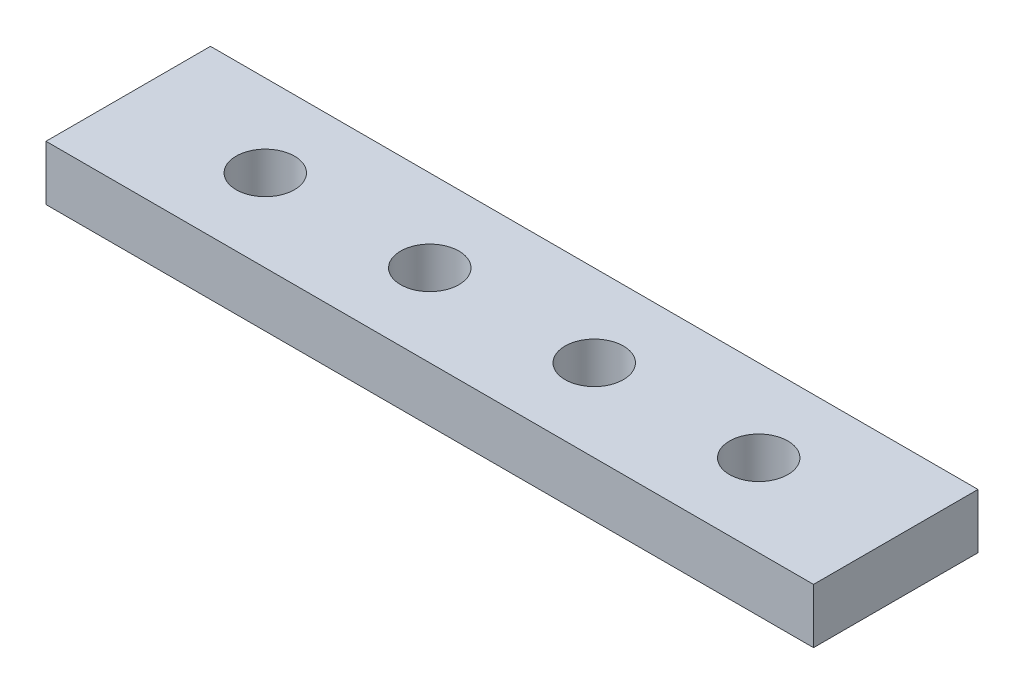
ISO-10303-21;
HEADER;
FILE_DESCRIPTION(('STEP AP214'),'2;1');
FILE_NAME('part.step','',(''),(''),'','','');
FILE_SCHEMA(('AUTOMOTIVE_DESIGN { 1 0 10303 214 1 1 1 1 }'));
ENDSEC;
DATA;
#1=APPLICATION_CONTEXT('core data for automotive mechanical design processes');
#2=APPLICATION_PROTOCOL_DEFINITION('international standard','automotive_design',2000,#1);
#3=PRODUCT_CONTEXT('',#1,'mechanical');
#4=PRODUCT('Part','Part','',(#3));
#5=PRODUCT_RELATED_PRODUCT_CATEGORY('part','',(#4));
#6=PRODUCT_DEFINITION_FORMATION('','',#4);
#7=PRODUCT_DEFINITION_CONTEXT('part definition',#1,'design');
#8=PRODUCT_DEFINITION('design','',#6,#7);
#9=PRODUCT_DEFINITION_SHAPE('','',#8);
#10=(LENGTH_UNIT() NAMED_UNIT(*) SI_UNIT(.MILLI.,.METRE.));
#11=(NAMED_UNIT(*) PLANE_ANGLE_UNIT() SI_UNIT($,.RADIAN.));
#12=(NAMED_UNIT(*) SI_UNIT($,.STERADIAN.) SOLID_ANGLE_UNIT());
#13=UNCERTAINTY_MEASURE_WITH_UNIT(LENGTH_MEASURE(1.E-05),#10,'distance_accuracy_value','');
#14=(GEOMETRIC_REPRESENTATION_CONTEXT(3) GLOBAL_UNCERTAINTY_ASSIGNED_CONTEXT((#13)) GLOBAL_UNIT_ASSIGNED_CONTEXT((#10,
#11,#12)) REPRESENTATION_CONTEXT('',''));
#15=CARTESIAN_POINT('',(0.,0.,0.));
#16=DIRECTION('',(0.,0.,1.));
#17=DIRECTION('',(1.,0.,0.));
#18=AXIS2_PLACEMENT_3D('',#15,#16,#17);
#19=CARTESIAN_POINT('',(44.45,6.35,9.525));
#20=DIRECTION('',(-1.,0.,0.));
#21=DIRECTION('',(0.,0.,1.));
#22=AXIS2_PLACEMENT_3D('',#19,#20,#21);
#23=PLANE('',#22);
#24=DIRECTION('',(0.,0.,-1.));
#25=VECTOR('',#24,1.);
#26=CARTESIAN_POINT('',(44.45,0.,9.525));
#27=LINE('',#26,#25);
#28=CARTESIAN_POINT('',(44.45,0.,9.525));
#29=VERTEX_POINT('',#28);
#30=CARTESIAN_POINT('',(44.45,0.,-9.525));
#31=VERTEX_POINT('',#30);
#32=EDGE_CURVE('E96',#29,#31,#27,.T.);
#33=ORIENTED_EDGE('',*,*,#32,.T.);
#34=DIRECTION('',(0.,-1.,0.));
#35=VECTOR('',#34,1.);
#36=CARTESIAN_POINT('',(44.45,6.35,-9.525));
#37=LINE('',#36,#35);
#38=CARTESIAN_POINT('',(44.45,6.35,-9.525));
#39=VERTEX_POINT('',#38);
#40=EDGE_CURVE('E11',#39,#31,#37,.T.);
#41=ORIENTED_EDGE('',*,*,#40,.F.);
#42=DIRECTION('',(0.,0.,-1.));
#43=VECTOR('',#42,1.);
#44=CARTESIAN_POINT('',(44.45,6.35,9.525));
#45=LINE('',#44,#43);
#46=CARTESIAN_POINT('',(44.45,6.35,9.525));
#47=VERTEX_POINT('',#46);
#48=EDGE_CURVE('E84',#47,#39,#45,.T.);
#49=ORIENTED_EDGE('',*,*,#48,.F.);
#50=DIRECTION('',(0.,-1.,0.));
#51=VECTOR('',#50,1.);
#52=CARTESIAN_POINT('',(44.45,6.35,9.525));
#53=LINE('',#52,#51);
#54=EDGE_CURVE('E92',#47,#29,#53,.T.);
#55=ORIENTED_EDGE('',*,*,#54,.T.);
#56=EDGE_LOOP('',(#33,#41,#49,#55));
#57=FACE_BOUND('',#56,.T.);
#58=ADVANCED_FACE('F33',(#57),#23,.F.);
#59=CARTESIAN_POINT('',(-44.45,6.35,-9.525));
#60=DIRECTION('',(0.,0.,1.));
#61=DIRECTION('',(1.,0.,0.));
#62=AXIS2_PLACEMENT_3D('',#59,#60,#61);
#63=PLANE('',#62);
#64=DIRECTION('',(-1.,0.,0.));
#65=VECTOR('',#64,1.);
#66=CARTESIAN_POINT('',(-44.45,0.,-9.525));
#67=LINE('',#66,#65);
#68=CARTESIAN_POINT('',(-44.45,0.,-9.525));
#69=VERTEX_POINT('',#68);
#70=EDGE_CURVE('E88',#31,#69,#67,.T.);
#71=ORIENTED_EDGE('',*,*,#70,.T.);
#72=DIRECTION('',(0.,-1.,0.));
#73=VECTOR('',#72,1.);
#74=CARTESIAN_POINT('',(-44.45,6.35,-9.525));
#75=LINE('',#74,#73);
#76=CARTESIAN_POINT('',(-44.45,6.35,-9.525));
#77=VERTEX_POINT('',#76);
#78=EDGE_CURVE('E41',#77,#69,#75,.T.);
#79=ORIENTED_EDGE('',*,*,#78,.F.);
#80=DIRECTION('',(-1.,0.,0.));
#81=VECTOR('',#80,1.);
#82=CARTESIAN_POINT('',(-44.45,6.35,-9.525));
#83=LINE('',#82,#81);
#84=EDGE_CURVE('E79',#39,#77,#83,.T.);
#85=ORIENTED_EDGE('',*,*,#84,.F.);
#86=ORIENTED_EDGE('',*,*,#40,.T.);
#87=EDGE_LOOP('',(#71,#79,#85,#86));
#88=FACE_BOUND('',#87,.T.);
#89=ADVANCED_FACE('F87',(#88),#63,.F.);
#90=CARTESIAN_POINT('',(-44.45,6.35,9.525));
#91=DIRECTION('',(1.,0.,0.));
#92=DIRECTION('',(0.,0.,-1.));
#93=AXIS2_PLACEMENT_3D('',#90,#91,#92);
#94=PLANE('',#93);
#95=DIRECTION('',(0.,0.,1.));
#96=VECTOR('',#95,1.);
#97=CARTESIAN_POINT('',(-44.45,0.,9.525));
#98=LINE('',#97,#96);
#99=CARTESIAN_POINT('',(-44.45,0.,9.525));
#100=VERTEX_POINT('',#99);
#101=EDGE_CURVE('E66',#69,#100,#98,.T.);
#102=ORIENTED_EDGE('',*,*,#101,.T.);
#103=DIRECTION('',(0.,-1.,0.));
#104=VECTOR('',#103,1.);
#105=CARTESIAN_POINT('',(-44.45,6.35,9.525));
#106=LINE('',#105,#104);
#107=CARTESIAN_POINT('',(-44.45,6.35,9.525));
#108=VERTEX_POINT('',#107);
#109=EDGE_CURVE('E89',#108,#100,#106,.T.);
#110=ORIENTED_EDGE('',*,*,#109,.F.);
#111=DIRECTION('',(0.,0.,1.));
#112=VECTOR('',#111,1.);
#113=CARTESIAN_POINT('',(-44.45,6.35,9.525));
#114=LINE('',#113,#112);
#115=EDGE_CURVE('E82',#77,#108,#114,.T.);
#116=ORIENTED_EDGE('',*,*,#115,.F.);
#117=ORIENTED_EDGE('',*,*,#78,.T.);
#118=EDGE_LOOP('',(#102,#110,#116,#117));
#119=FACE_BOUND('',#118,.T.);
#120=ADVANCED_FACE('F90',(#119),#94,.F.);
#121=CARTESIAN_POINT('',(-44.45,6.35,9.525));
#122=DIRECTION('',(0.,0.,-1.));
#123=DIRECTION('',(-1.,0.,0.));
#124=AXIS2_PLACEMENT_3D('',#121,#122,#123);
#125=PLANE('',#124);
#126=DIRECTION('',(1.,0.,0.));
#127=VECTOR('',#126,1.);
#128=CARTESIAN_POINT('',(-44.45,0.,9.525));
#129=LINE('',#128,#127);
#130=EDGE_CURVE('E72',#100,#29,#129,.T.);
#131=ORIENTED_EDGE('',*,*,#130,.T.);
#132=ORIENTED_EDGE('',*,*,#54,.F.);
#133=DIRECTION('',(1.,0.,0.));
#134=VECTOR('',#133,1.);
#135=CARTESIAN_POINT('',(-44.45,6.35,9.525));
#136=LINE('',#135,#134);
#137=EDGE_CURVE('E49',#108,#47,#136,.T.);
#138=ORIENTED_EDGE('',*,*,#137,.F.);
#139=ORIENTED_EDGE('',*,*,#109,.T.);
#140=EDGE_LOOP('',(#131,#132,#138,#139));
#141=FACE_BOUND('',#140,.T.);
#142=ADVANCED_FACE('F104',(#141),#125,.F.);
#143=CARTESIAN_POINT('',(0.,6.35,0.));
#144=DIRECTION('',(0.,-1.,0.));
#145=DIRECTION('',(0.,0.,-1.));
#146=AXIS2_PLACEMENT_3D('',#143,#144,#145);
#147=PLANE('',#146);
#148=CARTESIAN_POINT('',(-28.575,6.35,0.));
#149=DIRECTION('',(0.,-1.,0.));
#150=DIRECTION('',(0.,0.,-1.));
#151=AXIS2_PLACEMENT_3D('',#148,#149,#150);
#152=CIRCLE('',#151,3.3782);
#153=CARTESIAN_POINT('',(-28.575,6.35,-3.3782));
#154=VERTEX_POINT('',#153);
#155=EDGE_CURVE('E127',#154,#154,#152,.T.);
#156=ORIENTED_EDGE('',*,*,#155,.T.);
#157=EDGE_LOOP('',(#156));
#158=FACE_BOUND('',#157,.T.);
#159=CARTESIAN_POINT('',(-9.525,6.35,0.));
#160=DIRECTION('',(0.,-1.,0.));
#161=DIRECTION('',(0.,0.,-1.));
#162=AXIS2_PLACEMENT_3D('',#159,#160,#161);
#163=CIRCLE('',#162,3.3782);
#164=CARTESIAN_POINT('',(-9.525,6.35,-3.3782));
#165=VERTEX_POINT('',#164);
#166=EDGE_CURVE('E121',#165,#165,#163,.T.);
#167=ORIENTED_EDGE('',*,*,#166,.T.);
#168=EDGE_LOOP('',(#167));
#169=FACE_BOUND('',#168,.T.);
#170=CARTESIAN_POINT('',(9.525,6.35,0.));
#171=DIRECTION('',(0.,-1.,0.));
#172=DIRECTION('',(0.,0.,-1.));
#173=AXIS2_PLACEMENT_3D('',#170,#171,#172);
#174=CIRCLE('',#173,3.3782);
#175=CARTESIAN_POINT('',(9.525,6.35,-3.3782));
#176=VERTEX_POINT('',#175);
#177=EDGE_CURVE('E115',#176,#176,#174,.T.);
#178=ORIENTED_EDGE('',*,*,#177,.T.);
#179=EDGE_LOOP('',(#178));
#180=FACE_BOUND('',#179,.T.);
#181=CARTESIAN_POINT('',(28.575,6.35,0.));
#182=DIRECTION('',(0.,-1.,0.));
#183=DIRECTION('',(0.,0.,-1.));
#184=AXIS2_PLACEMENT_3D('',#181,#182,#183);
#185=CIRCLE('',#184,3.3782);
#186=CARTESIAN_POINT('',(28.575,6.35,-3.3782));
#187=VERTEX_POINT('',#186);
#188=EDGE_CURVE('E99',#187,#187,#185,.T.);
#189=ORIENTED_EDGE('',*,*,#188,.T.);
#190=EDGE_LOOP('',(#189));
#191=FACE_BOUND('',#190,.T.);
#192=ORIENTED_EDGE('',*,*,#48,.T.);
#193=ORIENTED_EDGE('',*,*,#84,.T.);
#194=ORIENTED_EDGE('',*,*,#115,.T.);
#195=ORIENTED_EDGE('',*,*,#137,.T.);
#196=EDGE_LOOP('',(#192,#193,#194,#195));
#197=FACE_BOUND('',#196,.T.);
#198=ADVANCED_FACE('F80',(#158,#169,#180,#191,#197),#147,.F.);
#199=CARTESIAN_POINT('',(0.,0.,0.));
#200=DIRECTION('',(0.,-1.,0.));
#201=DIRECTION('',(0.,0.,-1.));
#202=AXIS2_PLACEMENT_3D('',#199,#200,#201);
#203=PLANE('',#202);
#204=CARTESIAN_POINT('',(-28.575,0.,0.));
#205=DIRECTION('',(0.,-1.,0.));
#206=DIRECTION('',(0.,0.,-1.));
#207=AXIS2_PLACEMENT_3D('',#204,#205,#206);
#208=CIRCLE('',#207,3.3782);
#209=CARTESIAN_POINT('',(-28.575,0.,-3.3782));
#210=VERTEX_POINT('',#209);
#211=EDGE_CURVE('E130',#210,#210,#208,.T.);
#212=ORIENTED_EDGE('',*,*,#211,.F.);
#213=EDGE_LOOP('',(#212));
#214=FACE_BOUND('',#213,.T.);
#215=CARTESIAN_POINT('',(-9.525,0.,0.));
#216=DIRECTION('',(0.,-1.,0.));
#217=DIRECTION('',(0.,0.,-1.));
#218=AXIS2_PLACEMENT_3D('',#215,#216,#217);
#219=CIRCLE('',#218,3.3782);
#220=CARTESIAN_POINT('',(-9.525,0.,-3.3782));
#221=VERTEX_POINT('',#220);
#222=EDGE_CURVE('E124',#221,#221,#219,.T.);
#223=ORIENTED_EDGE('',*,*,#222,.F.);
#224=EDGE_LOOP('',(#223));
#225=FACE_BOUND('',#224,.T.);
#226=CARTESIAN_POINT('',(9.525,0.,0.));
#227=DIRECTION('',(0.,-1.,0.));
#228=DIRECTION('',(0.,0.,-1.));
#229=AXIS2_PLACEMENT_3D('',#226,#227,#228);
#230=CIRCLE('',#229,3.3782);
#231=CARTESIAN_POINT('',(9.525,0.,-3.3782));
#232=VERTEX_POINT('',#231);
#233=EDGE_CURVE('E118',#232,#232,#230,.T.);
#234=ORIENTED_EDGE('',*,*,#233,.F.);
#235=EDGE_LOOP('',(#234));
#236=FACE_BOUND('',#235,.T.);
#237=CARTESIAN_POINT('',(28.575,0.,0.));
#238=DIRECTION('',(0.,-1.,0.));
#239=DIRECTION('',(0.,0.,-1.));
#240=AXIS2_PLACEMENT_3D('',#237,#238,#239);
#241=CIRCLE('',#240,3.3782);
#242=CARTESIAN_POINT('',(28.575,0.,-3.3782));
#243=VERTEX_POINT('',#242);
#244=EDGE_CURVE('E112',#243,#243,#241,.T.);
#245=ORIENTED_EDGE('',*,*,#244,.F.);
#246=EDGE_LOOP('',(#245));
#247=FACE_BOUND('',#246,.T.);
#248=ORIENTED_EDGE('',*,*,#32,.F.);
#249=ORIENTED_EDGE('',*,*,#130,.F.);
#250=ORIENTED_EDGE('',*,*,#101,.F.);
#251=ORIENTED_EDGE('',*,*,#70,.F.);
#252=EDGE_LOOP('',(#248,#249,#250,#251));
#253=FACE_BOUND('',#252,.T.);
#254=ADVANCED_FACE('F107',(#214,#225,#236,#247,#253),#203,.T.);
#255=CARTESIAN_POINT('',(28.575,0.,0.));
#256=DIRECTION('',(0.,-1.,0.));
#257=DIRECTION('',(0.,0.,-1.));
#258=AXIS2_PLACEMENT_3D('',#255,#256,#257);
#259=CYLINDRICAL_SURFACE('',#258,3.3782);
#260=ORIENTED_EDGE('',*,*,#188,.F.);
#261=EDGE_LOOP('',(#260));
#262=FACE_BOUND('',#261,.T.);
#263=ORIENTED_EDGE('',*,*,#244,.T.);
#264=EDGE_LOOP('',(#263));
#265=FACE_BOUND('',#264,.T.);
#266=ADVANCED_FACE('F138',(#262,#265),#259,.F.);
#267=CARTESIAN_POINT('',(9.525,0.,0.));
#268=DIRECTION('',(0.,-1.,0.));
#269=DIRECTION('',(0.,0.,-1.));
#270=AXIS2_PLACEMENT_3D('',#267,#268,#269);
#271=CYLINDRICAL_SURFACE('',#270,3.3782);
#272=ORIENTED_EDGE('',*,*,#177,.F.);
#273=EDGE_LOOP('',(#272));
#274=FACE_BOUND('',#273,.T.);
#275=ORIENTED_EDGE('',*,*,#233,.T.);
#276=EDGE_LOOP('',(#275));
#277=FACE_BOUND('',#276,.T.);
#278=ADVANCED_FACE('F147',(#274,#277),#271,.F.);
#279=CARTESIAN_POINT('',(-9.525,0.,0.));
#280=DIRECTION('',(0.,-1.,0.));
#281=DIRECTION('',(0.,0.,-1.));
#282=AXIS2_PLACEMENT_3D('',#279,#280,#281);
#283=CYLINDRICAL_SURFACE('',#282,3.3782);
#284=ORIENTED_EDGE('',*,*,#166,.F.);
#285=EDGE_LOOP('',(#284));
#286=FACE_BOUND('',#285,.T.);
#287=ORIENTED_EDGE('',*,*,#222,.T.);
#288=EDGE_LOOP('',(#287));
#289=FACE_BOUND('',#288,.T.);
#290=ADVANCED_FACE('F154',(#286,#289),#283,.F.);
#291=CARTESIAN_POINT('',(-28.575,0.,0.));
#292=DIRECTION('',(0.,-1.,0.));
#293=DIRECTION('',(0.,0.,-1.));
#294=AXIS2_PLACEMENT_3D('',#291,#292,#293);
#295=CYLINDRICAL_SURFACE('',#294,3.3782);
#296=ORIENTED_EDGE('',*,*,#155,.F.);
#297=EDGE_LOOP('',(#296));
#298=FACE_BOUND('',#297,.T.);
#299=ORIENTED_EDGE('',*,*,#211,.T.);
#300=EDGE_LOOP('',(#299));
#301=FACE_BOUND('',#300,.T.);
#302=ADVANCED_FACE('F134',(#298,#301),#295,.F.);
#303=CLOSED_SHELL('',(#58,#89,#120,#142,#198,#254,#266,#278,#290,#302));
#304=MANIFOLD_SOLID_BREP('B2',#303);
#305=ADVANCED_BREP_SHAPE_REPRESENTATION('',(#18,#304),#14);
#306=SHAPE_DEFINITION_REPRESENTATION(#9,#305);
ENDSEC;
END-ISO-10303-21;
